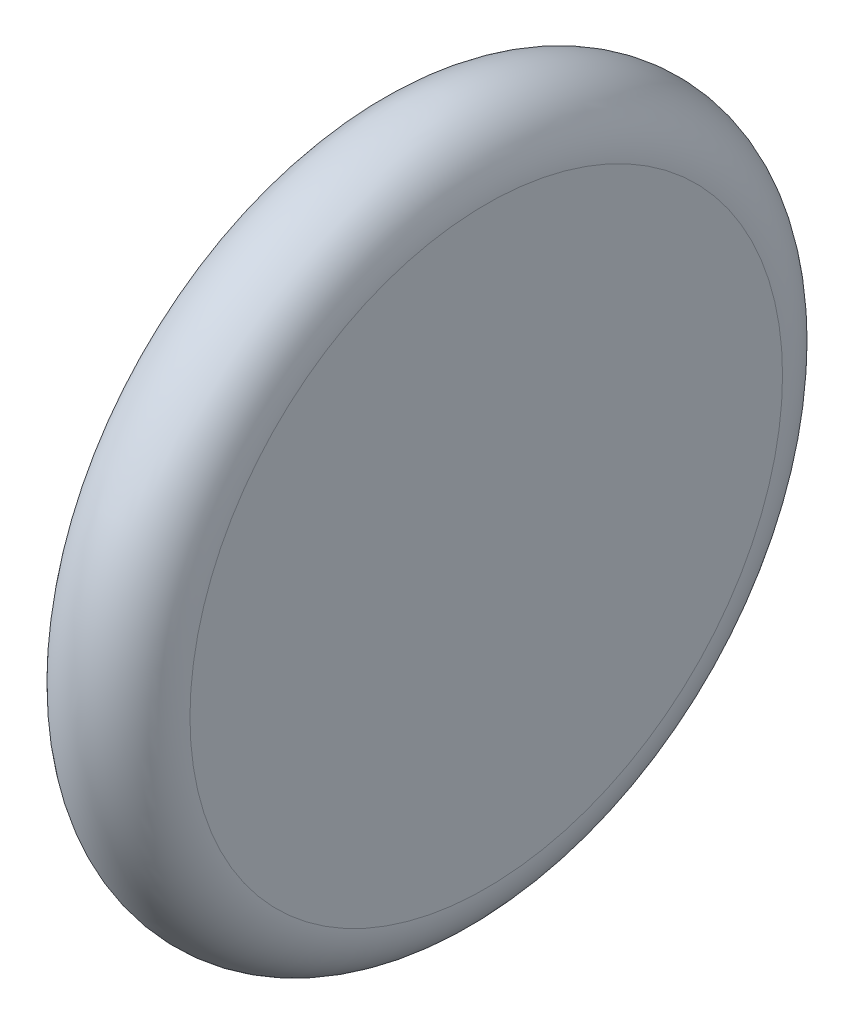
ISO-10303-21;
HEADER;
FILE_DESCRIPTION(('STEP AP214'),'2;1');
FILE_NAME('part.step','',(''),(''),'','','');
FILE_SCHEMA(('AUTOMOTIVE_DESIGN { 1 0 10303 214 1 1 1 1 }'));
ENDSEC;
DATA;
#1=APPLICATION_CONTEXT('core data for automotive mechanical design processes');
#2=APPLICATION_PROTOCOL_DEFINITION('international standard','automotive_design',2000,#1);
#3=PRODUCT_CONTEXT('',#1,'mechanical');
#4=PRODUCT('Part','Part','',(#3));
#5=PRODUCT_RELATED_PRODUCT_CATEGORY('part','',(#4));
#6=PRODUCT_DEFINITION_FORMATION('','',#4);
#7=PRODUCT_DEFINITION_CONTEXT('part definition',#1,'design');
#8=PRODUCT_DEFINITION('design','',#6,#7);
#9=PRODUCT_DEFINITION_SHAPE('','',#8);
#10=(LENGTH_UNIT() NAMED_UNIT(*) SI_UNIT(.MILLI.,.METRE.));
#11=(NAMED_UNIT(*) PLANE_ANGLE_UNIT() SI_UNIT($,.RADIAN.));
#12=(NAMED_UNIT(*) SI_UNIT($,.STERADIAN.) SOLID_ANGLE_UNIT());
#13=UNCERTAINTY_MEASURE_WITH_UNIT(LENGTH_MEASURE(1.E-05),#10,'distance_accuracy_value','');
#14=(GEOMETRIC_REPRESENTATION_CONTEXT(3) GLOBAL_UNCERTAINTY_ASSIGNED_CONTEXT((#13)) GLOBAL_UNIT_ASSIGNED_CONTEXT((#10,
#11,#12)) REPRESENTATION_CONTEXT('',''));
#15=CARTESIAN_POINT('',(0.,0.,0.));
#16=DIRECTION('',(0.,0.,1.));
#17=DIRECTION('',(1.,0.,0.));
#18=AXIS2_PLACEMENT_3D('',#15,#16,#17);
#19=CARTESIAN_POINT('',(12.,0.,0.));
#20=DIRECTION('',(-1.,0.,0.));
#21=DIRECTION('',(0.,0.,1.));
#22=AXIS2_PLACEMENT_3D('',#19,#20,#21);
#23=TOROIDAL_SURFACE('',#22,25.,5.);
#24=CARTESIAN_POINT('',(17.,0.,0.));
#25=DIRECTION('',(-1.,0.,0.));
#26=DIRECTION('',(0.,0.,1.));
#27=AXIS2_PLACEMENT_3D('',#24,#25,#26);
#28=CIRCLE('',#27,25.);
#29=CARTESIAN_POINT('',(17.,0.,25.));
#30=VERTEX_POINT('',#29);
#31=EDGE_CURVE('E10',#30,#30,#28,.F.);
#32=ORIENTED_EDGE('',*,*,#31,.F.);
#33=EDGE_LOOP('',(#32));
#34=FACE_BOUND('',#33,.T.);
#35=CARTESIAN_POINT('',(7.,0.,0.));
#36=DIRECTION('',(-1.,0.,0.));
#37=DIRECTION('',(0.,0.,1.));
#38=AXIS2_PLACEMENT_3D('',#35,#36,#37);
#39=CIRCLE('',#38,25.);
#40=CARTESIAN_POINT('',(7.,0.,25.));
#41=VERTEX_POINT('',#40);
#42=EDGE_CURVE('E42',#41,#41,#39,.T.);
#43=ORIENTED_EDGE('',*,*,#42,.F.);
#44=EDGE_LOOP('',(#43));
#45=FACE_BOUND('',#44,.T.);
#46=ADVANCED_FACE('F35',(#34,#45),#23,.T.);
#47=CARTESIAN_POINT('',(17.,0.,0.));
#48=DIRECTION('',(-1.,0.,0.));
#49=DIRECTION('',(0.,0.,1.));
#50=AXIS2_PLACEMENT_3D('',#47,#48,#49);
#51=PLANE('',#50);
#52=ORIENTED_EDGE('',*,*,#31,.T.);
#53=EDGE_LOOP('',(#52));
#54=FACE_BOUND('',#53,.T.);
#55=ADVANCED_FACE('F75',(#54),#51,.F.);
#56=CARTESIAN_POINT('',(0.,0.,0.));
#57=DIRECTION('',(-1.,0.,0.));
#58=DIRECTION('',(0.,0.,1.));
#59=AXIS2_PLACEMENT_3D('',#56,#57,#58);
#60=CYLINDRICAL_SURFACE('',#59,25.);
#61=CARTESIAN_POINT('',(10.,0.,0.));
#62=DIRECTION('',(-1.,0.,0.));
#63=DIRECTION('',(0.,0.,1.));
#64=AXIS2_PLACEMENT_3D('',#61,#62,#63);
#65=CIRCLE('',#64,25.);
#66=CARTESIAN_POINT('',(10.,0.,25.));
#67=VERTEX_POINT('',#66);
#68=EDGE_CURVE('E46',#67,#67,#65,.T.);
#69=ORIENTED_EDGE('',*,*,#68,.F.);
#70=EDGE_LOOP('',(#69));
#71=FACE_BOUND('',#70,.T.);
#72=ORIENTED_EDGE('',*,*,#42,.T.);
#73=EDGE_LOOP('',(#72));
#74=FACE_BOUND('',#73,.T.);
#75=ADVANCED_FACE('F70',(#71,#74),#60,.F.);
#76=CARTESIAN_POINT('',(10.,5.,0.));
#77=DIRECTION('',(1.,0.,0.));
#78=DIRECTION('',(0.,0.,-1.));
#79=AXIS2_PLACEMENT_3D('',#76,#77,#78);
#80=PLANE('',#79);
#81=CARTESIAN_POINT('',(10.,0.,0.));
#82=DIRECTION('',(-1.,0.,0.));
#83=DIRECTION('',(0.,0.,1.));
#84=AXIS2_PLACEMENT_3D('',#81,#82,#83);
#85=CIRCLE('',#84,5.);
#86=CARTESIAN_POINT('',(10.,0.,5.));
#87=VERTEX_POINT('',#86);
#88=EDGE_CURVE('E50',#87,#87,#85,.T.);
#89=ORIENTED_EDGE('',*,*,#88,.F.);
#90=EDGE_LOOP('',(#89));
#91=FACE_BOUND('',#90,.T.);
#92=ORIENTED_EDGE('',*,*,#68,.T.);
#93=EDGE_LOOP('',(#92));
#94=FACE_BOUND('',#93,.T.);
#95=ADVANCED_FACE('F64',(#91,#94),#80,.F.);
#96=CARTESIAN_POINT('',(0.,0.,0.));
#97=DIRECTION('',(-1.,0.,0.));
#98=DIRECTION('',(0.,0.,1.));
#99=AXIS2_PLACEMENT_3D('',#96,#97,#98);
#100=CYLINDRICAL_SURFACE('',#99,5.);
#101=CARTESIAN_POINT('',(0.,0.,0.));
#102=DIRECTION('',(-1.,0.,0.));
#103=DIRECTION('',(0.,0.,1.));
#104=AXIS2_PLACEMENT_3D('',#101,#102,#103);
#105=CIRCLE('',#104,5.);
#106=CARTESIAN_POINT('',(0.,0.,5.));
#107=VERTEX_POINT('',#106);
#108=EDGE_CURVE('E55',#107,#107,#105,.T.);
#109=ORIENTED_EDGE('',*,*,#108,.F.);
#110=EDGE_LOOP('',(#109));
#111=FACE_BOUND('',#110,.T.);
#112=ORIENTED_EDGE('',*,*,#88,.T.);
#113=EDGE_LOOP('',(#112));
#114=FACE_BOUND('',#113,.T.);
#115=ADVANCED_FACE('F61',(#111,#114),#100,.T.);
#116=CARTESIAN_POINT('',(0.,0.,0.));
#117=DIRECTION('',(1.,0.,0.));
#118=DIRECTION('',(0.,0.,-1.));
#119=AXIS2_PLACEMENT_3D('',#116,#117,#118);
#120=PLANE('',#119);
#121=ORIENTED_EDGE('',*,*,#108,.T.);
#122=EDGE_LOOP('',(#121));
#123=FACE_BOUND('',#122,.T.);
#124=ADVANCED_FACE('F59',(#123),#120,.F.);
#125=CLOSED_SHELL('',(#46,#55,#75,#95,#115,#124));
#126=MANIFOLD_SOLID_BREP('B2',#125);
#127=ADVANCED_BREP_SHAPE_REPRESENTATION('',(#18,#126),#14);
#128=SHAPE_DEFINITION_REPRESENTATION(#9,#127);
ENDSEC;
END-ISO-10303-21;
